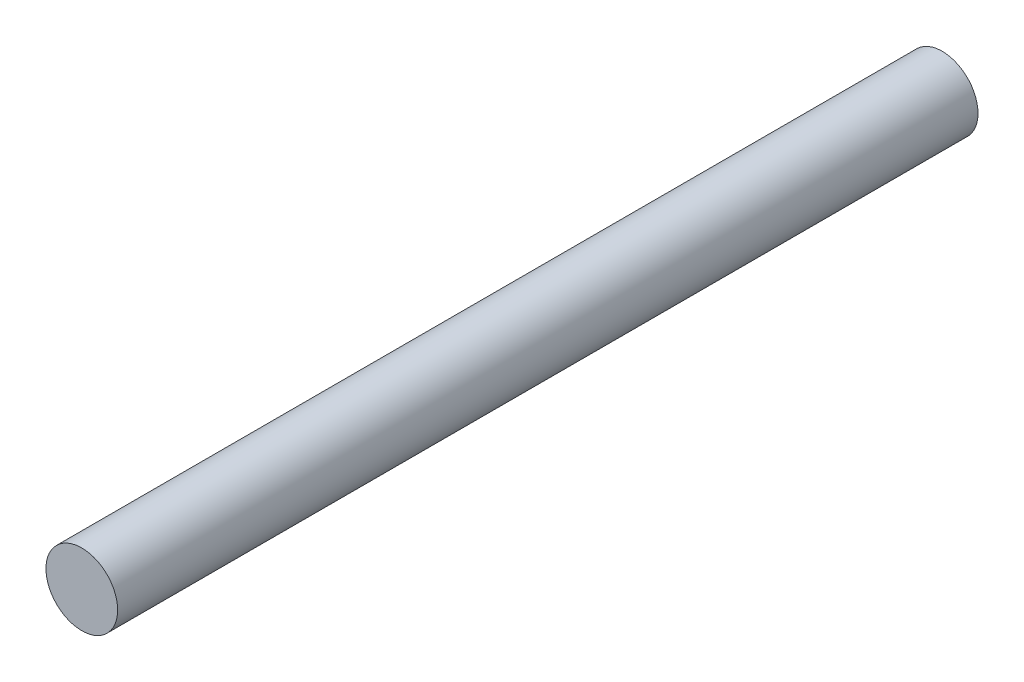
ISO-10303-21;
HEADER;
FILE_DESCRIPTION(('STEP AP214'),'2;1');
FILE_NAME('part.step','',(''),(''),'','','');
FILE_SCHEMA(('AUTOMOTIVE_DESIGN { 1 0 10303 214 1 1 1 1 }'));
ENDSEC;
DATA;
#1=APPLICATION_CONTEXT('core data for automotive mechanical design processes');
#2=APPLICATION_PROTOCOL_DEFINITION('international standard','automotive_design',2000,#1);
#3=PRODUCT_CONTEXT('',#1,'mechanical');
#4=PRODUCT('Part','Part','',(#3));
#5=PRODUCT_RELATED_PRODUCT_CATEGORY('part','',(#4));
#6=PRODUCT_DEFINITION_FORMATION('','',#4);
#7=PRODUCT_DEFINITION_CONTEXT('part definition',#1,'design');
#8=PRODUCT_DEFINITION('design','',#6,#7);
#9=PRODUCT_DEFINITION_SHAPE('','',#8);
#10=(LENGTH_UNIT() NAMED_UNIT(*) SI_UNIT(.MILLI.,.METRE.));
#11=(NAMED_UNIT(*) PLANE_ANGLE_UNIT() SI_UNIT($,.RADIAN.));
#12=(NAMED_UNIT(*) SI_UNIT($,.STERADIAN.) SOLID_ANGLE_UNIT());
#13=UNCERTAINTY_MEASURE_WITH_UNIT(LENGTH_MEASURE(1.E-05),#10,'distance_accuracy_value','');
#14=(GEOMETRIC_REPRESENTATION_CONTEXT(3) GLOBAL_UNCERTAINTY_ASSIGNED_CONTEXT((#13)) GLOBAL_UNIT_ASSIGNED_CONTEXT((#10,
#11,#12)) REPRESENTATION_CONTEXT('',''));
#15=CARTESIAN_POINT('',(0.,0.,0.));
#16=DIRECTION('',(0.,0.,1.));
#17=DIRECTION('',(1.,0.,0.));
#18=AXIS2_PLACEMENT_3D('',#15,#16,#17);
#19=CARTESIAN_POINT('',(0.,0.,150.));
#20=DIRECTION('',(0.,0.,-1.));
#21=DIRECTION('',(-1.,0.,0.));
#22=AXIS2_PLACEMENT_3D('',#19,#20,#21);
#23=CYLINDRICAL_SURFACE('',#22,6.25);
#24=CARTESIAN_POINT('',(0.,0.,150.));
#25=DIRECTION('',(0.,0.,1.));
#26=DIRECTION('',(1.,0.,0.));
#27=AXIS2_PLACEMENT_3D('',#24,#25,#26);
#28=CIRCLE('',#27,6.25);
#29=CARTESIAN_POINT('',(6.25,0.,150.));
#30=VERTEX_POINT('',#29);
#31=EDGE_CURVE('E10',#30,#30,#28,.T.);
#32=ORIENTED_EDGE('',*,*,#31,.F.);
#33=EDGE_LOOP('',(#32));
#34=FACE_BOUND('',#33,.T.);
#35=CARTESIAN_POINT('',(0.,0.,0.));
#36=DIRECTION('',(0.,0.,1.));
#37=DIRECTION('',(1.,0.,0.));
#38=AXIS2_PLACEMENT_3D('',#35,#36,#37);
#39=CIRCLE('',#38,6.25);
#40=CARTESIAN_POINT('',(6.25,0.,0.));
#41=VERTEX_POINT('',#40);
#42=EDGE_CURVE('E34',#41,#41,#39,.T.);
#43=ORIENTED_EDGE('',*,*,#42,.T.);
#44=EDGE_LOOP('',(#43));
#45=FACE_BOUND('',#44,.T.);
#46=ADVANCED_FACE('F31',(#34,#45),#23,.T.);
#47=CARTESIAN_POINT('',(0.,0.,150.));
#48=DIRECTION('',(0.,0.,1.));
#49=DIRECTION('',(1.,0.,0.));
#50=AXIS2_PLACEMENT_3D('',#47,#48,#49);
#51=PLANE('',#50);
#52=ORIENTED_EDGE('',*,*,#31,.T.);
#53=EDGE_LOOP('',(#52));
#54=FACE_BOUND('',#53,.T.);
#55=ADVANCED_FACE('F46',(#54),#51,.T.);
#56=CARTESIAN_POINT('',(0.,0.,0.));
#57=DIRECTION('',(0.,0.,1.));
#58=DIRECTION('',(1.,0.,0.));
#59=AXIS2_PLACEMENT_3D('',#56,#57,#58);
#60=PLANE('',#59);
#61=ORIENTED_EDGE('',*,*,#42,.F.);
#62=EDGE_LOOP('',(#61));
#63=FACE_BOUND('',#62,.T.);
#64=ADVANCED_FACE('F44',(#63),#60,.F.);
#65=CLOSED_SHELL('',(#46,#55,#64));
#66=MANIFOLD_SOLID_BREP('B2',#65);
#67=ADVANCED_BREP_SHAPE_REPRESENTATION('',(#18,#66),#14);
#68=SHAPE_DEFINITION_REPRESENTATION(#9,#67);
ENDSEC;
END-ISO-10303-21;
